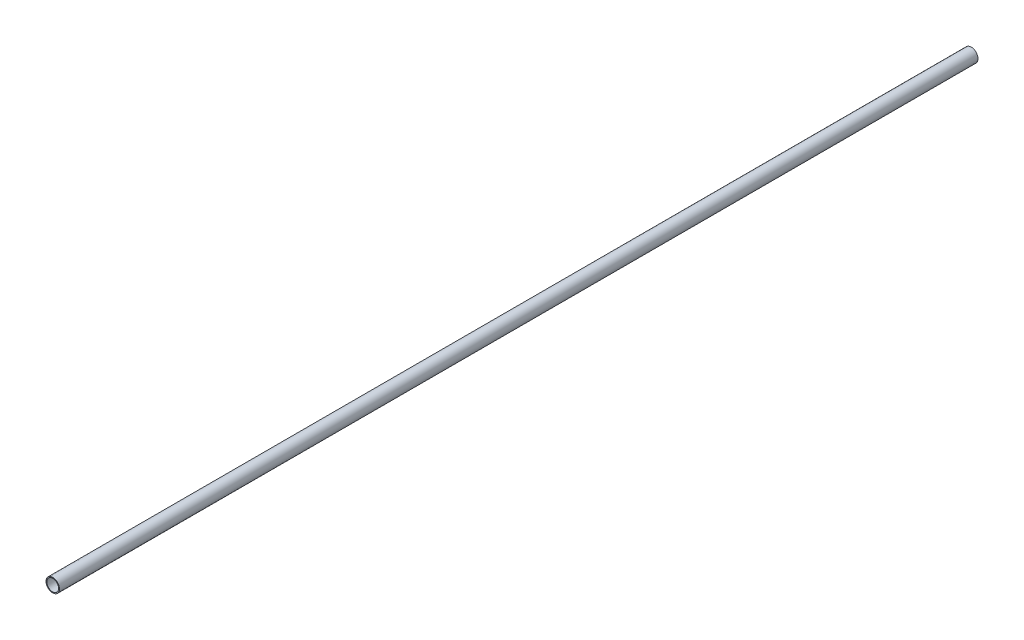
ISO-10303-21;
HEADER;
FILE_DESCRIPTION(('STEP AP214'),'2;1');
FILE_NAME('part.step','',(''),(''),'','','');
FILE_SCHEMA(('AUTOMOTIVE_DESIGN { 1 0 10303 214 1 1 1 1 }'));
ENDSEC;
DATA;
#1=APPLICATION_CONTEXT('core data for automotive mechanical design processes');
#2=APPLICATION_PROTOCOL_DEFINITION('international standard','automotive_design',2000,#1);
#3=PRODUCT_CONTEXT('',#1,'mechanical');
#4=PRODUCT('Part','Part','',(#3));
#5=PRODUCT_RELATED_PRODUCT_CATEGORY('part','',(#4));
#6=PRODUCT_DEFINITION_FORMATION('','',#4);
#7=PRODUCT_DEFINITION_CONTEXT('part definition',#1,'design');
#8=PRODUCT_DEFINITION('design','',#6,#7);
#9=PRODUCT_DEFINITION_SHAPE('','',#8);
#10=(LENGTH_UNIT() NAMED_UNIT(*) SI_UNIT(.MILLI.,.METRE.));
#11=(NAMED_UNIT(*) PLANE_ANGLE_UNIT() SI_UNIT($,.RADIAN.));
#12=(NAMED_UNIT(*) SI_UNIT($,.STERADIAN.) SOLID_ANGLE_UNIT());
#13=UNCERTAINTY_MEASURE_WITH_UNIT(LENGTH_MEASURE(1.E-05),#10,'distance_accuracy_value','');
#14=(GEOMETRIC_REPRESENTATION_CONTEXT(3) GLOBAL_UNCERTAINTY_ASSIGNED_CONTEXT((#13)) GLOBAL_UNIT_ASSIGNED_CONTEXT((#10,
#11,#12)) REPRESENTATION_CONTEXT('',''));
#15=CARTESIAN_POINT('',(0.,0.,0.));
#16=DIRECTION('',(0.,0.,1.));
#17=DIRECTION('',(1.,0.,0.));
#18=AXIS2_PLACEMENT_3D('',#15,#16,#17);
#19=CARTESIAN_POINT('',(0.,0.,742.95));
#20=DIRECTION('',(0.,0.,1.));
#21=DIRECTION('',(1.,0.,0.));
#22=AXIS2_PLACEMENT_3D('',#19,#20,#21);
#23=PLANE('',#22);
#24=CARTESIAN_POINT('',(0.,0.,742.95));
#25=DIRECTION('',(0.,0.,1.));
#26=DIRECTION('',(1.,0.,0.));
#27=AXIS2_PLACEMENT_3D('',#24,#25,#26);
#28=CIRCLE('',#27,10.922);
#29=CARTESIAN_POINT('',(10.922,0.,742.95));
#30=VERTEX_POINT('',#29);
#31=EDGE_CURVE('E10',#30,#30,#28,.T.);
#32=ORIENTED_EDGE('',*,*,#31,.T.);
#33=EDGE_LOOP('',(#32));
#34=FACE_BOUND('',#33,.T.);
#35=CARTESIAN_POINT('',(0.,0.,742.95));
#36=DIRECTION('',(0.,0.,1.));
#37=DIRECTION('',(1.,0.,0.));
#38=AXIS2_PLACEMENT_3D('',#35,#36,#37);
#39=CIRCLE('',#38,9.525);
#40=CARTESIAN_POINT('',(9.525,0.,742.95));
#41=VERTEX_POINT('',#40);
#42=EDGE_CURVE('E51',#41,#41,#39,.T.);
#43=ORIENTED_EDGE('',*,*,#42,.F.);
#44=EDGE_LOOP('',(#43));
#45=FACE_BOUND('',#44,.T.);
#46=ADVANCED_FACE('F43',(#34,#45),#23,.T.);
#47=CARTESIAN_POINT('',(0.,0.,742.95));
#48=DIRECTION('',(0.,0.,-1.));
#49=DIRECTION('',(-1.,0.,0.));
#50=AXIS2_PLACEMENT_3D('',#47,#48,#49);
#51=CYLINDRICAL_SURFACE('',#50,10.922);
#52=ORIENTED_EDGE('',*,*,#31,.F.);
#53=EDGE_LOOP('',(#52));
#54=FACE_BOUND('',#53,.T.);
#55=CARTESIAN_POINT('',(0.,0.,-742.95));
#56=DIRECTION('',(0.,0.,1.));
#57=DIRECTION('',(1.,0.,0.));
#58=AXIS2_PLACEMENT_3D('',#55,#56,#57);
#59=CIRCLE('',#58,10.922);
#60=CARTESIAN_POINT('',(10.922,0.,-742.95));
#61=VERTEX_POINT('',#60);
#62=EDGE_CURVE('E56',#61,#61,#59,.T.);
#63=ORIENTED_EDGE('',*,*,#62,.T.);
#64=EDGE_LOOP('',(#63));
#65=FACE_BOUND('',#64,.T.);
#66=ADVANCED_FACE('F45',(#54,#65),#51,.T.);
#67=CARTESIAN_POINT('',(0.,0.,742.95));
#68=DIRECTION('',(0.,0.,-1.));
#69=DIRECTION('',(-1.,0.,0.));
#70=AXIS2_PLACEMENT_3D('',#67,#68,#69);
#71=CYLINDRICAL_SURFACE('',#70,9.525);
#72=ORIENTED_EDGE('',*,*,#42,.T.);
#73=EDGE_LOOP('',(#72));
#74=FACE_BOUND('',#73,.T.);
#75=CARTESIAN_POINT('',(0.,0.,-742.95));
#76=DIRECTION('',(0.,0.,1.));
#77=DIRECTION('',(1.,0.,0.));
#78=AXIS2_PLACEMENT_3D('',#75,#76,#77);
#79=CIRCLE('',#78,9.525);
#80=CARTESIAN_POINT('',(9.525,0.,-742.95));
#81=VERTEX_POINT('',#80);
#82=EDGE_CURVE('E61',#81,#81,#79,.T.);
#83=ORIENTED_EDGE('',*,*,#82,.F.);
#84=EDGE_LOOP('',(#83));
#85=FACE_BOUND('',#84,.T.);
#86=ADVANCED_FACE('F71',(#74,#85),#71,.F.);
#87=CARTESIAN_POINT('',(0.,0.,-742.95));
#88=DIRECTION('',(0.,0.,1.));
#89=DIRECTION('',(1.,0.,0.));
#90=AXIS2_PLACEMENT_3D('',#87,#88,#89);
#91=PLANE('',#90);
#92=ORIENTED_EDGE('',*,*,#82,.T.);
#93=EDGE_LOOP('',(#92));
#94=FACE_BOUND('',#93,.T.);
#95=ORIENTED_EDGE('',*,*,#62,.F.);
#96=EDGE_LOOP('',(#95));
#97=FACE_BOUND('',#96,.T.);
#98=ADVANCED_FACE('F68',(#94,#97),#91,.F.);
#99=CLOSED_SHELL('',(#46,#66,#86,#98));
#100=MANIFOLD_SOLID_BREP('B2',#99);
#101=ADVANCED_BREP_SHAPE_REPRESENTATION('',(#18,#100),#14);
#102=SHAPE_DEFINITION_REPRESENTATION(#9,#101);
ENDSEC;
END-ISO-10303-21;
